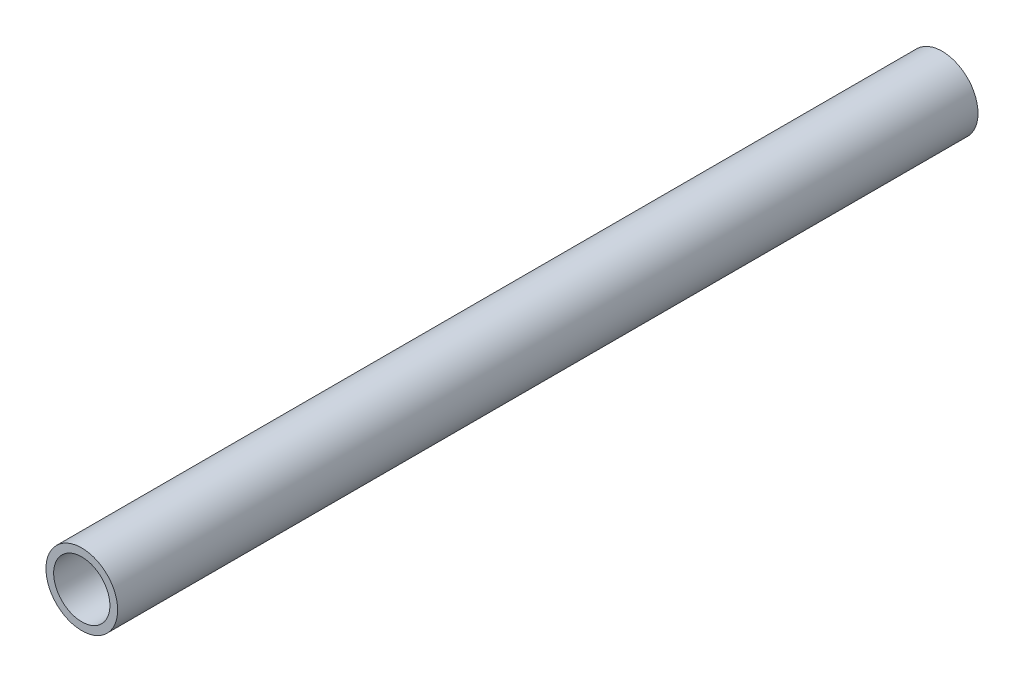
ISO-10303-21;
HEADER;
FILE_DESCRIPTION(('STEP AP214'),'2;1');
FILE_NAME('part.step','',(''),(''),'','','');
FILE_SCHEMA(('AUTOMOTIVE_DESIGN { 1 0 10303 214 1 1 1 1 }'));
ENDSEC;
DATA;
#1=APPLICATION_CONTEXT('core data for automotive mechanical design processes');
#2=APPLICATION_PROTOCOL_DEFINITION('international standard','automotive_design',2000,#1);
#3=PRODUCT_CONTEXT('',#1,'mechanical');
#4=PRODUCT('Part','Part','',(#3));
#5=PRODUCT_RELATED_PRODUCT_CATEGORY('part','',(#4));
#6=PRODUCT_DEFINITION_FORMATION('','',#4);
#7=PRODUCT_DEFINITION_CONTEXT('part definition',#1,'design');
#8=PRODUCT_DEFINITION('design','',#6,#7);
#9=PRODUCT_DEFINITION_SHAPE('','',#8);
#10=(LENGTH_UNIT() NAMED_UNIT(*) SI_UNIT(.MILLI.,.METRE.));
#11=(NAMED_UNIT(*) PLANE_ANGLE_UNIT() SI_UNIT($,.RADIAN.));
#12=(NAMED_UNIT(*) SI_UNIT($,.STERADIAN.) SOLID_ANGLE_UNIT());
#13=UNCERTAINTY_MEASURE_WITH_UNIT(LENGTH_MEASURE(1.E-05),#10,'distance_accuracy_value','');
#14=(GEOMETRIC_REPRESENTATION_CONTEXT(3) GLOBAL_UNCERTAINTY_ASSIGNED_CONTEXT((#13)) GLOBAL_UNIT_ASSIGNED_CONTEXT((#10,
#11,#12)) REPRESENTATION_CONTEXT('',''));
#15=CARTESIAN_POINT('',(0.,0.,0.));
#16=DIRECTION('',(0.,0.,1.));
#17=DIRECTION('',(1.,0.,0.));
#18=AXIS2_PLACEMENT_3D('',#15,#16,#17);
#19=CARTESIAN_POINT('',(0.,0.,160.));
#20=DIRECTION('',(0.,0.,1.));
#21=DIRECTION('',(1.,0.,0.));
#22=AXIS2_PLACEMENT_3D('',#19,#20,#21);
#23=PLANE('',#22);
#24=CARTESIAN_POINT('',(0.,0.,160.));
#25=DIRECTION('',(0.,0.,1.));
#26=DIRECTION('',(1.,0.,0.));
#27=AXIS2_PLACEMENT_3D('',#24,#25,#26);
#28=CIRCLE('',#27,13.335);
#29=CARTESIAN_POINT('',(13.335,0.,160.));
#30=VERTEX_POINT('',#29);
#31=EDGE_CURVE('E11',#30,#30,#28,.T.);
#32=ORIENTED_EDGE('',*,*,#31,.T.);
#33=EDGE_LOOP('',(#32));
#34=FACE_BOUND('',#33,.T.);
#35=CARTESIAN_POINT('',(0.,0.,160.));
#36=DIRECTION('',(0.,0.,1.));
#37=DIRECTION('',(1.,0.,0.));
#38=AXIS2_PLACEMENT_3D('',#35,#36,#37);
#39=CIRCLE('',#38,10.4648);
#40=CARTESIAN_POINT('',(10.4648,0.,160.));
#41=VERTEX_POINT('',#40);
#42=EDGE_CURVE('E48',#41,#41,#39,.T.);
#43=ORIENTED_EDGE('',*,*,#42,.F.);
#44=EDGE_LOOP('',(#43));
#45=FACE_BOUND('',#44,.T.);
#46=ADVANCED_FACE('F37',(#34,#45),#23,.T.);
#47=CARTESIAN_POINT('',(0.,0.,-160.));
#48=DIRECTION('',(0.,0.,1.));
#49=DIRECTION('',(1.,0.,0.));
#50=AXIS2_PLACEMENT_3D('',#47,#48,#49);
#51=PLANE('',#50);
#52=CARTESIAN_POINT('',(0.,0.,-160.));
#53=DIRECTION('',(0.,0.,1.));
#54=DIRECTION('',(1.,0.,0.));
#55=AXIS2_PLACEMENT_3D('',#52,#53,#54);
#56=CIRCLE('',#55,13.335);
#57=CARTESIAN_POINT('',(13.335,0.,-160.));
#58=VERTEX_POINT('',#57);
#59=EDGE_CURVE('E41',#58,#58,#56,.T.);
#60=ORIENTED_EDGE('',*,*,#59,.F.);
#61=EDGE_LOOP('',(#60));
#62=FACE_BOUND('',#61,.T.);
#63=CARTESIAN_POINT('',(0.,0.,-160.));
#64=DIRECTION('',(0.,0.,1.));
#65=DIRECTION('',(1.,0.,0.));
#66=AXIS2_PLACEMENT_3D('',#63,#64,#65);
#67=CIRCLE('',#66,10.4648);
#68=CARTESIAN_POINT('',(10.4648,0.,-160.));
#69=VERTEX_POINT('',#68);
#70=EDGE_CURVE('E50',#69,#69,#67,.T.);
#71=ORIENTED_EDGE('',*,*,#70,.T.);
#72=EDGE_LOOP('',(#71));
#73=FACE_BOUND('',#72,.T.);
#74=ADVANCED_FACE('F60',(#62,#73),#51,.F.);
#75=CARTESIAN_POINT('',(0.,0.,160.));
#76=DIRECTION('',(0.,0.,-1.));
#77=DIRECTION('',(-1.,0.,0.));
#78=AXIS2_PLACEMENT_3D('',#75,#76,#77);
#79=CYLINDRICAL_SURFACE('',#78,13.335);
#80=ORIENTED_EDGE('',*,*,#31,.F.);
#81=EDGE_LOOP('',(#80));
#82=FACE_BOUND('',#81,.T.);
#83=ORIENTED_EDGE('',*,*,#59,.T.);
#84=EDGE_LOOP('',(#83));
#85=FACE_BOUND('',#84,.T.);
#86=ADVANCED_FACE('F39',(#82,#85),#79,.T.);
#87=CARTESIAN_POINT('',(0.,0.,160.));
#88=DIRECTION('',(0.,0.,-1.));
#89=DIRECTION('',(-1.,0.,0.));
#90=AXIS2_PLACEMENT_3D('',#87,#88,#89);
#91=CYLINDRICAL_SURFACE('',#90,10.4648);
#92=ORIENTED_EDGE('',*,*,#42,.T.);
#93=EDGE_LOOP('',(#92));
#94=FACE_BOUND('',#93,.T.);
#95=ORIENTED_EDGE('',*,*,#70,.F.);
#96=EDGE_LOOP('',(#95));
#97=FACE_BOUND('',#96,.T.);
#98=ADVANCED_FACE('F56',(#94,#97),#91,.F.);
#99=CLOSED_SHELL('',(#46,#74,#86,#98));
#100=MANIFOLD_SOLID_BREP('B2',#99);
#101=ADVANCED_BREP_SHAPE_REPRESENTATION('',(#18,#100),#14);
#102=SHAPE_DEFINITION_REPRESENTATION(#9,#101);
ENDSEC;
END-ISO-10303-21;
